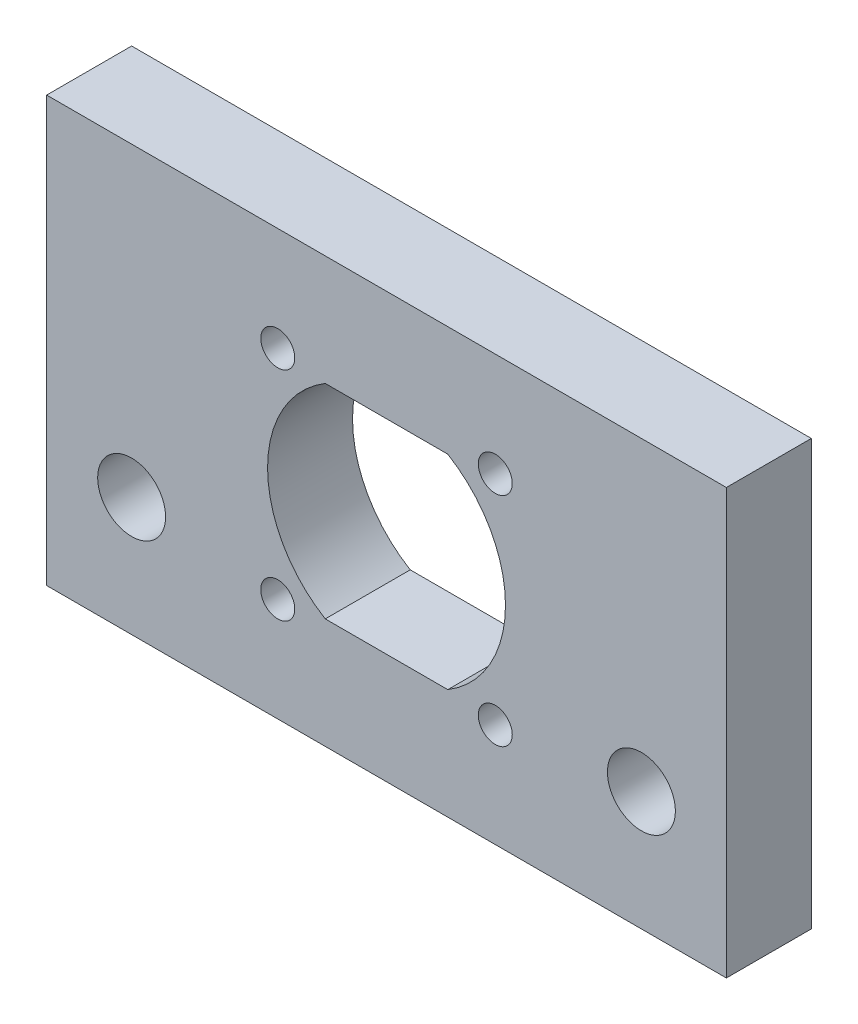
ISO-10303-21;
HEADER;
FILE_DESCRIPTION(('STEP AP214'),'2;1');
FILE_NAME('part.step','',(''),(''),'','','');
FILE_SCHEMA(('AUTOMOTIVE_DESIGN { 1 0 10303 214 1 1 1 1 }'));
ENDSEC;
DATA;
#1=APPLICATION_CONTEXT('core data for automotive mechanical design processes');
#2=APPLICATION_PROTOCOL_DEFINITION('international standard','automotive_design',2000,#1);
#3=PRODUCT_CONTEXT('',#1,'mechanical');
#4=PRODUCT('Part','Part','',(#3));
#5=PRODUCT_RELATED_PRODUCT_CATEGORY('part','',(#4));
#6=PRODUCT_DEFINITION_FORMATION('','',#4);
#7=PRODUCT_DEFINITION_CONTEXT('part definition',#1,'design');
#8=PRODUCT_DEFINITION('design','',#6,#7);
#9=PRODUCT_DEFINITION_SHAPE('','',#8);
#10=(LENGTH_UNIT() NAMED_UNIT(*) SI_UNIT(.MILLI.,.METRE.));
#11=(NAMED_UNIT(*) PLANE_ANGLE_UNIT() SI_UNIT($,.RADIAN.));
#12=(NAMED_UNIT(*) SI_UNIT($,.STERADIAN.) SOLID_ANGLE_UNIT());
#13=UNCERTAINTY_MEASURE_WITH_UNIT(LENGTH_MEASURE(1.E-05),#10,'distance_accuracy_value','');
#14=(GEOMETRIC_REPRESENTATION_CONTEXT(3) GLOBAL_UNCERTAINTY_ASSIGNED_CONTEXT((#13)) GLOBAL_UNIT_ASSIGNED_CONTEXT((#10,
#11,#12)) REPRESENTATION_CONTEXT('',''));
#15=CARTESIAN_POINT('',(0.,0.,0.));
#16=DIRECTION('',(0.,0.,1.));
#17=DIRECTION('',(1.,0.,0.));
#18=AXIS2_PLACEMENT_3D('',#15,#16,#17);
#19=CARTESIAN_POINT('',(0.,0.,5.));
#20=DIRECTION('',(0.,0.,1.));
#21=DIRECTION('',(1.,0.,0.));
#22=AXIS2_PLACEMENT_3D('',#19,#20,#21);
#23=PLANE('',#22);
#24=CARTESIAN_POINT('',(-6.4,-6.4,5.));
#25=DIRECTION('',(0.,0.,1.));
#26=DIRECTION('',(-1.,0.,0.));
#27=AXIS2_PLACEMENT_3D('',#24,#25,#26);
#28=CIRCLE('',#27,1.);
#29=CARTESIAN_POINT('',(-7.4,-6.4,5.));
#30=VERTEX_POINT('',#29);
#31=EDGE_CURVE('E262',#30,#30,#28,.T.);
#32=ORIENTED_EDGE('',*,*,#31,.F.);
#33=EDGE_LOOP('',(#32));
#34=FACE_BOUND('',#33,.T.);
#35=CARTESIAN_POINT('',(6.4,6.4,5.));
#36=DIRECTION('',(0.,0.,1.));
#37=DIRECTION('',(-1.,0.,0.));
#38=AXIS2_PLACEMENT_3D('',#35,#36,#37);
#39=CIRCLE('',#38,1.);
#40=CARTESIAN_POINT('',(5.4,6.4,5.));
#41=VERTEX_POINT('',#40);
#42=EDGE_CURVE('E274',#41,#41,#39,.T.);
#43=ORIENTED_EDGE('',*,*,#42,.F.);
#44=EDGE_LOOP('',(#43));
#45=FACE_BOUND('',#44,.T.);
#46=CARTESIAN_POINT('',(-6.4,6.4,5.));
#47=DIRECTION('',(0.,0.,1.));
#48=DIRECTION('',(1.,0.,0.));
#49=AXIS2_PLACEMENT_3D('',#46,#47,#48);
#50=CIRCLE('',#49,1.);
#51=CARTESIAN_POINT('',(-5.4,6.4,5.));
#52=VERTEX_POINT('',#51);
#53=EDGE_CURVE('E136',#52,#52,#50,.T.);
#54=ORIENTED_EDGE('',*,*,#53,.F.);
#55=EDGE_LOOP('',(#54));
#56=FACE_BOUND('',#55,.T.);
#57=DIRECTION('',(0.,1.,0.));
#58=VECTOR('',#57,1.);
#59=CARTESIAN_POINT('',(20.,12.5,5.));
#60=LINE('',#59,#58);
#61=CARTESIAN_POINT('',(20.,-12.5,5.));
#62=VERTEX_POINT('',#61);
#63=CARTESIAN_POINT('',(20.,12.5,5.));
#64=VERTEX_POINT('',#63);
#65=EDGE_CURVE('E146',#62,#64,#60,.T.);
#66=ORIENTED_EDGE('',*,*,#65,.T.);
#67=DIRECTION('',(-1.,0.,0.));
#68=VECTOR('',#67,1.);
#69=CARTESIAN_POINT('',(-20.,12.5,5.));
#70=LINE('',#69,#68);
#71=CARTESIAN_POINT('',(-20.,12.5,5.));
#72=VERTEX_POINT('',#71);
#73=EDGE_CURVE('E149',#64,#72,#70,.T.);
#74=ORIENTED_EDGE('',*,*,#73,.T.);
#75=DIRECTION('',(0.,-1.,0.));
#76=VECTOR('',#75,1.);
#77=CARTESIAN_POINT('',(-20.,12.5,5.));
#78=LINE('',#77,#76);
#79=CARTESIAN_POINT('',(-20.,-12.5,5.));
#80=VERTEX_POINT('',#79);
#81=EDGE_CURVE('E152',#72,#80,#78,.T.);
#82=ORIENTED_EDGE('',*,*,#81,.T.);
#83=DIRECTION('',(1.,0.,0.));
#84=VECTOR('',#83,1.);
#85=CARTESIAN_POINT('',(-20.,-12.5,5.));
#86=LINE('',#85,#84);
#87=EDGE_CURVE('E154',#80,#62,#86,.T.);
#88=ORIENTED_EDGE('',*,*,#87,.T.);
#89=EDGE_LOOP('',(#66,#74,#82,#88));
#90=FACE_BOUND('',#89,.T.);
#91=DIRECTION('',(-1.,0.,0.));
#92=VECTOR('',#91,1.);
#93=CARTESIAN_POINT('',(-3.60555127546399,6.,5.));
#94=LINE('',#93,#92);
#95=CARTESIAN_POINT('',(3.60555127546399,6.,5.));
#96=VERTEX_POINT('',#95);
#97=CARTESIAN_POINT('',(-3.60555127546399,6.,5.));
#98=VERTEX_POINT('',#97);
#99=EDGE_CURVE('E115',#96,#98,#94,.T.);
#100=ORIENTED_EDGE('',*,*,#99,.F.);
#101=CARTESIAN_POINT('',(0.,0.,5.));
#102=DIRECTION('',(0.,0.,1.));
#103=DIRECTION('',(1.,0.,0.));
#104=AXIS2_PLACEMENT_3D('',#101,#102,#103);
#105=CIRCLE('',#104,7.);
#106=CARTESIAN_POINT('',(3.60555127546399,-6.,5.));
#107=VERTEX_POINT('',#106);
#108=EDGE_CURVE('E107',#107,#96,#105,.T.);
#109=ORIENTED_EDGE('',*,*,#108,.F.);
#110=DIRECTION('',(1.,0.,0.));
#111=VECTOR('',#110,1.);
#112=CARTESIAN_POINT('',(-3.60555127546399,-6.,5.));
#113=LINE('',#112,#111);
#114=CARTESIAN_POINT('',(-3.60555127546399,-6.,5.));
#115=VERTEX_POINT('',#114);
#116=EDGE_CURVE('E130',#115,#107,#113,.T.);
#117=ORIENTED_EDGE('',*,*,#116,.F.);
#118=CARTESIAN_POINT('',(0.,0.,5.));
#119=DIRECTION('',(0.,0.,1.));
#120=DIRECTION('',(1.,0.,0.));
#121=AXIS2_PLACEMENT_3D('',#118,#119,#120);
#122=CIRCLE('',#121,7.);
#123=EDGE_CURVE('E128',#98,#115,#122,.T.);
#124=ORIENTED_EDGE('',*,*,#123,.F.);
#125=EDGE_LOOP('',(#100,#109,#117,#124));
#126=FACE_BOUND('',#125,.T.);
#127=CARTESIAN_POINT('',(15.,-5.5,5.));
#128=DIRECTION('',(0.,0.,1.));
#129=DIRECTION('',(1.,0.,0.));
#130=AXIS2_PLACEMENT_3D('',#127,#128,#129);
#131=CIRCLE('',#130,2.);
#132=CARTESIAN_POINT('',(17.,-5.5,5.));
#133=VERTEX_POINT('',#132);
#134=EDGE_CURVE('E280',#133,#133,#131,.T.);
#135=ORIENTED_EDGE('',*,*,#134,.F.);
#136=EDGE_LOOP('',(#135));
#137=FACE_BOUND('',#136,.T.);
#138=CARTESIAN_POINT('',(6.4,-6.4,5.));
#139=DIRECTION('',(0.,0.,1.));
#140=DIRECTION('',(1.,0.,0.));
#141=AXIS2_PLACEMENT_3D('',#138,#139,#140);
#142=CIRCLE('',#141,1.);
#143=CARTESIAN_POINT('',(7.40000000000001,-6.4,5.));
#144=VERTEX_POINT('',#143);
#145=EDGE_CURVE('E268',#144,#144,#142,.T.);
#146=ORIENTED_EDGE('',*,*,#145,.F.);
#147=EDGE_LOOP('',(#146));
#148=FACE_BOUND('',#147,.T.);
#149=CARTESIAN_POINT('',(-15.,-5.5,5.));
#150=DIRECTION('',(0.,0.,1.));
#151=DIRECTION('',(-1.,0.,0.));
#152=AXIS2_PLACEMENT_3D('',#149,#150,#151);
#153=CIRCLE('',#152,2.);
#154=CARTESIAN_POINT('',(-17.,-5.5,5.));
#155=VERTEX_POINT('',#154);
#156=EDGE_CURVE('E253',#155,#155,#153,.T.);
#157=ORIENTED_EDGE('',*,*,#156,.F.);
#158=EDGE_LOOP('',(#157));
#159=FACE_BOUND('',#158,.T.);
#160=ADVANCED_FACE('F42',(#34,#45,#56,#90,#126,#137,#148,#159),#23,.T.);
#161=CARTESIAN_POINT('',(0.,0.,0.));
#162=DIRECTION('',(0.,0.,1.));
#163=DIRECTION('',(1.,0.,0.));
#164=AXIS2_PLACEMENT_3D('',#161,#162,#163);
#165=PLANE('',#164);
#166=DIRECTION('',(0.,1.,0.));
#167=VECTOR('',#166,1.);
#168=CARTESIAN_POINT('',(20.,12.5,0.));
#169=LINE('',#168,#167);
#170=CARTESIAN_POINT('',(20.,-12.5,0.));
#171=VERTEX_POINT('',#170);
#172=CARTESIAN_POINT('',(20.,12.5,0.));
#173=VERTEX_POINT('',#172);
#174=EDGE_CURVE('E123',#171,#173,#169,.T.);
#175=ORIENTED_EDGE('',*,*,#174,.F.);
#176=DIRECTION('',(1.,0.,0.));
#177=VECTOR('',#176,1.);
#178=CARTESIAN_POINT('',(-20.,-12.5,0.));
#179=LINE('',#178,#177);
#180=CARTESIAN_POINT('',(-20.,-12.5,0.));
#181=VERTEX_POINT('',#180);
#182=EDGE_CURVE('E150',#181,#171,#179,.T.);
#183=ORIENTED_EDGE('',*,*,#182,.F.);
#184=DIRECTION('',(0.,-1.,0.));
#185=VECTOR('',#184,1.);
#186=CARTESIAN_POINT('',(-20.,12.5,0.));
#187=LINE('',#186,#185);
#188=CARTESIAN_POINT('',(-20.,12.5,0.));
#189=VERTEX_POINT('',#188);
#190=EDGE_CURVE('E161',#189,#181,#187,.T.);
#191=ORIENTED_EDGE('',*,*,#190,.F.);
#192=DIRECTION('',(-1.,0.,0.));
#193=VECTOR('',#192,1.);
#194=CARTESIAN_POINT('',(-20.,12.5,0.));
#195=LINE('',#194,#193);
#196=EDGE_CURVE('E159',#173,#189,#195,.T.);
#197=ORIENTED_EDGE('',*,*,#196,.F.);
#198=EDGE_LOOP('',(#175,#183,#191,#197));
#199=FACE_BOUND('',#198,.T.);
#200=CARTESIAN_POINT('',(0.,0.,0.));
#201=DIRECTION('',(0.,0.,1.));
#202=DIRECTION('',(1.,0.,0.));
#203=AXIS2_PLACEMENT_3D('',#200,#201,#202);
#204=CIRCLE('',#203,7.);
#205=CARTESIAN_POINT('',(3.60555127546399,-6.,0.));
#206=VERTEX_POINT('',#205);
#207=CARTESIAN_POINT('',(3.60555127546399,6.,0.));
#208=VERTEX_POINT('',#207);
#209=EDGE_CURVE('E65',#206,#208,#204,.T.);
#210=ORIENTED_EDGE('',*,*,#209,.T.);
#211=DIRECTION('',(-1.,0.,0.));
#212=VECTOR('',#211,1.);
#213=CARTESIAN_POINT('',(-3.60555127546399,6.,0.));
#214=LINE('',#213,#212);
#215=CARTESIAN_POINT('',(-3.60555127546399,6.,0.));
#216=VERTEX_POINT('',#215);
#217=EDGE_CURVE('E122',#208,#216,#214,.T.);
#218=ORIENTED_EDGE('',*,*,#217,.T.);
#219=CARTESIAN_POINT('',(0.,0.,0.));
#220=DIRECTION('',(0.,0.,1.));
#221=DIRECTION('',(1.,0.,0.));
#222=AXIS2_PLACEMENT_3D('',#219,#220,#221);
#223=CIRCLE('',#222,7.);
#224=CARTESIAN_POINT('',(-3.60555127546399,-6.,0.));
#225=VERTEX_POINT('',#224);
#226=EDGE_CURVE('E138',#216,#225,#223,.T.);
#227=ORIENTED_EDGE('',*,*,#226,.T.);
#228=DIRECTION('',(1.,0.,0.));
#229=VECTOR('',#228,1.);
#230=CARTESIAN_POINT('',(-3.60555127546399,-6.,0.));
#231=LINE('',#230,#229);
#232=EDGE_CURVE('E116',#225,#206,#231,.T.);
#233=ORIENTED_EDGE('',*,*,#232,.T.);
#234=EDGE_LOOP('',(#210,#218,#227,#233));
#235=FACE_BOUND('',#234,.T.);
#236=CARTESIAN_POINT('',(-6.4,6.4,0.));
#237=DIRECTION('',(0.,0.,1.));
#238=DIRECTION('',(1.,0.,0.));
#239=AXIS2_PLACEMENT_3D('',#236,#237,#238);
#240=CIRCLE('',#239,1.);
#241=CARTESIAN_POINT('',(-5.4,6.4,0.));
#242=VERTEX_POINT('',#241);
#243=EDGE_CURVE('E283',#242,#242,#240,.T.);
#244=ORIENTED_EDGE('',*,*,#243,.T.);
#245=EDGE_LOOP('',(#244));
#246=FACE_BOUND('',#245,.T.);
#247=CARTESIAN_POINT('',(15.,-5.5,0.));
#248=DIRECTION('',(0.,0.,1.));
#249=DIRECTION('',(1.,0.,0.));
#250=AXIS2_PLACEMENT_3D('',#247,#248,#249);
#251=CIRCLE('',#250,2.);
#252=CARTESIAN_POINT('',(17.,-5.5,0.));
#253=VERTEX_POINT('',#252);
#254=EDGE_CURVE('E277',#253,#253,#251,.T.);
#255=ORIENTED_EDGE('',*,*,#254,.T.);
#256=EDGE_LOOP('',(#255));
#257=FACE_BOUND('',#256,.T.);
#258=CARTESIAN_POINT('',(6.4,6.4,0.));
#259=DIRECTION('',(0.,0.,1.));
#260=DIRECTION('',(-1.,0.,0.));
#261=AXIS2_PLACEMENT_3D('',#258,#259,#260);
#262=CIRCLE('',#261,1.);
#263=CARTESIAN_POINT('',(5.4,6.4,0.));
#264=VERTEX_POINT('',#263);
#265=EDGE_CURVE('E271',#264,#264,#262,.T.);
#266=ORIENTED_EDGE('',*,*,#265,.T.);
#267=EDGE_LOOP('',(#266));
#268=FACE_BOUND('',#267,.T.);
#269=CARTESIAN_POINT('',(6.4,-6.4,0.));
#270=DIRECTION('',(0.,0.,1.));
#271=DIRECTION('',(1.,0.,0.));
#272=AXIS2_PLACEMENT_3D('',#269,#270,#271);
#273=CIRCLE('',#272,1.);
#274=CARTESIAN_POINT('',(7.40000000000001,-6.4,0.));
#275=VERTEX_POINT('',#274);
#276=EDGE_CURVE('E265',#275,#275,#273,.T.);
#277=ORIENTED_EDGE('',*,*,#276,.T.);
#278=EDGE_LOOP('',(#277));
#279=FACE_BOUND('',#278,.T.);
#280=CARTESIAN_POINT('',(-6.4,-6.4,0.));
#281=DIRECTION('',(0.,0.,1.));
#282=DIRECTION('',(-1.,0.,0.));
#283=AXIS2_PLACEMENT_3D('',#280,#281,#282);
#284=CIRCLE('',#283,1.);
#285=CARTESIAN_POINT('',(-7.4,-6.4,0.));
#286=VERTEX_POINT('',#285);
#287=EDGE_CURVE('E259',#286,#286,#284,.T.);
#288=ORIENTED_EDGE('',*,*,#287,.T.);
#289=EDGE_LOOP('',(#288));
#290=FACE_BOUND('',#289,.T.);
#291=CARTESIAN_POINT('',(-15.,-5.5,0.));
#292=DIRECTION('',(0.,0.,1.));
#293=DIRECTION('',(-1.,0.,0.));
#294=AXIS2_PLACEMENT_3D('',#291,#292,#293);
#295=CIRCLE('',#294,2.);
#296=CARTESIAN_POINT('',(-17.,-5.5,0.));
#297=VERTEX_POINT('',#296);
#298=EDGE_CURVE('E256',#297,#297,#295,.T.);
#299=ORIENTED_EDGE('',*,*,#298,.T.);
#300=EDGE_LOOP('',(#299));
#301=FACE_BOUND('',#300,.T.);
#302=ADVANCED_FACE('F179',(#199,#235,#246,#257,#268,#279,#290,#301),#165,.F.);
#303=CARTESIAN_POINT('',(20.,12.5,5.));
#304=DIRECTION('',(-1.,0.,0.));
#305=DIRECTION('',(0.,-1.,0.));
#306=AXIS2_PLACEMENT_3D('',#303,#304,#305);
#307=PLANE('',#306);
#308=ORIENTED_EDGE('',*,*,#174,.T.);
#309=DIRECTION('',(0.,0.,-1.));
#310=VECTOR('',#309,1.);
#311=CARTESIAN_POINT('',(20.,12.5,5.));
#312=LINE('',#311,#310);
#313=EDGE_CURVE('E13',#64,#173,#312,.T.);
#314=ORIENTED_EDGE('',*,*,#313,.F.);
#315=ORIENTED_EDGE('',*,*,#65,.F.);
#316=DIRECTION('',(0.,0.,-1.));
#317=VECTOR('',#316,1.);
#318=CARTESIAN_POINT('',(20.,-12.5,5.));
#319=LINE('',#318,#317);
#320=EDGE_CURVE('E156',#62,#171,#319,.T.);
#321=ORIENTED_EDGE('',*,*,#320,.T.);
#322=EDGE_LOOP('',(#308,#314,#315,#321));
#323=FACE_BOUND('',#322,.T.);
#324=ADVANCED_FACE('F44',(#323),#307,.F.);
#325=CARTESIAN_POINT('',(-20.,12.5,5.));
#326=DIRECTION('',(0.,-1.,0.));
#327=DIRECTION('',(0.,0.,-1.));
#328=AXIS2_PLACEMENT_3D('',#325,#326,#327);
#329=PLANE('',#328);
#330=ORIENTED_EDGE('',*,*,#196,.T.);
#331=DIRECTION('',(0.,0.,-1.));
#332=VECTOR('',#331,1.);
#333=CARTESIAN_POINT('',(-20.,12.5,5.));
#334=LINE('',#333,#332);
#335=EDGE_CURVE('E50',#72,#189,#334,.T.);
#336=ORIENTED_EDGE('',*,*,#335,.F.);
#337=ORIENTED_EDGE('',*,*,#73,.F.);
#338=ORIENTED_EDGE('',*,*,#313,.T.);
#339=EDGE_LOOP('',(#330,#336,#337,#338));
#340=FACE_BOUND('',#339,.T.);
#341=ADVANCED_FACE('F189',(#340),#329,.F.);
#342=CARTESIAN_POINT('',(-20.,12.5,5.));
#343=DIRECTION('',(1.,0.,0.));
#344=DIRECTION('',(0.,1.,0.));
#345=AXIS2_PLACEMENT_3D('',#342,#343,#344);
#346=PLANE('',#345);
#347=ORIENTED_EDGE('',*,*,#190,.T.);
#348=DIRECTION('',(0.,0.,-1.));
#349=VECTOR('',#348,1.);
#350=CARTESIAN_POINT('',(-20.,-12.5,5.));
#351=LINE('',#350,#349);
#352=EDGE_CURVE('E166',#80,#181,#351,.T.);
#353=ORIENTED_EDGE('',*,*,#352,.F.);
#354=ORIENTED_EDGE('',*,*,#81,.F.);
#355=ORIENTED_EDGE('',*,*,#335,.T.);
#356=EDGE_LOOP('',(#347,#353,#354,#355));
#357=FACE_BOUND('',#356,.T.);
#358=ADVANCED_FACE('F173',(#357),#346,.F.);
#359=CARTESIAN_POINT('',(-20.,-12.5,5.));
#360=DIRECTION('',(0.,1.,0.));
#361=DIRECTION('',(0.,0.,1.));
#362=AXIS2_PLACEMENT_3D('',#359,#360,#361);
#363=PLANE('',#362);
#364=ORIENTED_EDGE('',*,*,#182,.T.);
#365=ORIENTED_EDGE('',*,*,#320,.F.);
#366=ORIENTED_EDGE('',*,*,#87,.F.);
#367=ORIENTED_EDGE('',*,*,#352,.T.);
#368=EDGE_LOOP('',(#364,#365,#366,#367));
#369=FACE_BOUND('',#368,.T.);
#370=ADVANCED_FACE('F183',(#369),#363,.F.);
#371=CARTESIAN_POINT('',(0.,0.,5.));
#372=DIRECTION('',(0.,0.,-1.));
#373=DIRECTION('',(-1.,0.,0.));
#374=AXIS2_PLACEMENT_3D('',#371,#372,#373);
#375=CYLINDRICAL_SURFACE('',#374,7.);
#376=ORIENTED_EDGE('',*,*,#209,.F.);
#377=DIRECTION('',(0.,0.,-1.));
#378=VECTOR('',#377,1.);
#379=CARTESIAN_POINT('',(3.60555127546399,-6.,5.));
#380=LINE('',#379,#378);
#381=EDGE_CURVE('E111',#107,#206,#380,.T.);
#382=ORIENTED_EDGE('',*,*,#381,.F.);
#383=ORIENTED_EDGE('',*,*,#108,.T.);
#384=DIRECTION('',(0.,0.,-1.));
#385=VECTOR('',#384,1.);
#386=CARTESIAN_POINT('',(3.60555127546399,6.,5.));
#387=LINE('',#386,#385);
#388=EDGE_CURVE('E110',#96,#208,#387,.T.);
#389=ORIENTED_EDGE('',*,*,#388,.T.);
#390=EDGE_LOOP('',(#376,#382,#383,#389));
#391=FACE_BOUND('',#390,.T.);
#392=ADVANCED_FACE('F109',(#391),#375,.F.);
#393=CARTESIAN_POINT('',(-3.60555127546399,6.,5.));
#394=DIRECTION('',(0.,-1.,0.));
#395=DIRECTION('',(0.,0.,-1.));
#396=AXIS2_PLACEMENT_3D('',#393,#394,#395);
#397=PLANE('',#396);
#398=ORIENTED_EDGE('',*,*,#217,.F.);
#399=ORIENTED_EDGE('',*,*,#388,.F.);
#400=ORIENTED_EDGE('',*,*,#99,.T.);
#401=DIRECTION('',(0.,0.,-1.));
#402=VECTOR('',#401,1.);
#403=CARTESIAN_POINT('',(-3.60555127546399,6.,5.));
#404=LINE('',#403,#402);
#405=EDGE_CURVE('E124',#98,#216,#404,.T.);
#406=ORIENTED_EDGE('',*,*,#405,.T.);
#407=EDGE_LOOP('',(#398,#399,#400,#406));
#408=FACE_BOUND('',#407,.T.);
#409=ADVANCED_FACE('F119',(#408),#397,.T.);
#410=CARTESIAN_POINT('',(0.,0.,5.));
#411=DIRECTION('',(0.,0.,-1.));
#412=DIRECTION('',(-1.,0.,0.));
#413=AXIS2_PLACEMENT_3D('',#410,#411,#412);
#414=CYLINDRICAL_SURFACE('',#413,7.);
#415=ORIENTED_EDGE('',*,*,#226,.F.);
#416=ORIENTED_EDGE('',*,*,#405,.F.);
#417=ORIENTED_EDGE('',*,*,#123,.T.);
#418=DIRECTION('',(0.,0.,-1.));
#419=VECTOR('',#418,1.);
#420=CARTESIAN_POINT('',(-3.60555127546399,-6.,5.));
#421=LINE('',#420,#419);
#422=EDGE_CURVE('E57',#115,#225,#421,.T.);
#423=ORIENTED_EDGE('',*,*,#422,.T.);
#424=EDGE_LOOP('',(#415,#416,#417,#423));
#425=FACE_BOUND('',#424,.T.);
#426=ADVANCED_FACE('F215',(#425),#414,.F.);
#427=CARTESIAN_POINT('',(-3.60555127546399,-6.,5.));
#428=DIRECTION('',(0.,1.,0.));
#429=DIRECTION('',(0.,0.,1.));
#430=AXIS2_PLACEMENT_3D('',#427,#428,#429);
#431=PLANE('',#430);
#432=ORIENTED_EDGE('',*,*,#232,.F.);
#433=ORIENTED_EDGE('',*,*,#422,.F.);
#434=ORIENTED_EDGE('',*,*,#116,.T.);
#435=ORIENTED_EDGE('',*,*,#381,.T.);
#436=EDGE_LOOP('',(#432,#433,#434,#435));
#437=FACE_BOUND('',#436,.T.);
#438=ADVANCED_FACE('F219',(#437),#431,.T.);
#439=CARTESIAN_POINT('',(-6.4,6.4,5.));
#440=DIRECTION('',(0.,0.,-1.));
#441=DIRECTION('',(-1.,0.,0.));
#442=AXIS2_PLACEMENT_3D('',#439,#440,#441);
#443=CYLINDRICAL_SURFACE('',#442,1.);
#444=ORIENTED_EDGE('',*,*,#53,.T.);
#445=EDGE_LOOP('',(#444));
#446=FACE_BOUND('',#445,.T.);
#447=ORIENTED_EDGE('',*,*,#243,.F.);
#448=EDGE_LOOP('',(#447));
#449=FACE_BOUND('',#448,.T.);
#450=ADVANCED_FACE('F225',(#446,#449),#443,.F.);
#451=CARTESIAN_POINT('',(15.,-5.5,5.));
#452=DIRECTION('',(0.,0.,-1.));
#453=DIRECTION('',(-1.,0.,0.));
#454=AXIS2_PLACEMENT_3D('',#451,#452,#453);
#455=CYLINDRICAL_SURFACE('',#454,2.);
#456=ORIENTED_EDGE('',*,*,#134,.T.);
#457=EDGE_LOOP('',(#456));
#458=FACE_BOUND('',#457,.T.);
#459=ORIENTED_EDGE('',*,*,#254,.F.);
#460=EDGE_LOOP('',(#459));
#461=FACE_BOUND('',#460,.T.);
#462=ADVANCED_FACE('F228',(#458,#461),#455,.F.);
#463=CARTESIAN_POINT('',(6.4,6.4,5.));
#464=DIRECTION('',(0.,0.,-1.));
#465=DIRECTION('',(-1.,0.,0.));
#466=AXIS2_PLACEMENT_3D('',#463,#464,#465);
#467=CYLINDRICAL_SURFACE('',#466,1.);
#468=ORIENTED_EDGE('',*,*,#42,.T.);
#469=EDGE_LOOP('',(#468));
#470=FACE_BOUND('',#469,.T.);
#471=ORIENTED_EDGE('',*,*,#265,.F.);
#472=EDGE_LOOP('',(#471));
#473=FACE_BOUND('',#472,.T.);
#474=ADVANCED_FACE('F232',(#470,#473),#467,.F.);
#475=CARTESIAN_POINT('',(6.4,-6.4,5.));
#476=DIRECTION('',(0.,0.,-1.));
#477=DIRECTION('',(-1.,0.,0.));
#478=AXIS2_PLACEMENT_3D('',#475,#476,#477);
#479=CYLINDRICAL_SURFACE('',#478,1.);
#480=ORIENTED_EDGE('',*,*,#145,.T.);
#481=EDGE_LOOP('',(#480));
#482=FACE_BOUND('',#481,.T.);
#483=ORIENTED_EDGE('',*,*,#276,.F.);
#484=EDGE_LOOP('',(#483));
#485=FACE_BOUND('',#484,.T.);
#486=ADVANCED_FACE('F236',(#482,#485),#479,.F.);
#487=CARTESIAN_POINT('',(-6.4,-6.4,5.));
#488=DIRECTION('',(0.,0.,-1.));
#489=DIRECTION('',(-1.,0.,0.));
#490=AXIS2_PLACEMENT_3D('',#487,#488,#489);
#491=CYLINDRICAL_SURFACE('',#490,1.);
#492=ORIENTED_EDGE('',*,*,#31,.T.);
#493=EDGE_LOOP('',(#492));
#494=FACE_BOUND('',#493,.T.);
#495=ORIENTED_EDGE('',*,*,#287,.F.);
#496=EDGE_LOOP('',(#495));
#497=FACE_BOUND('',#496,.T.);
#498=ADVANCED_FACE('F240',(#494,#497),#491,.F.);
#499=CARTESIAN_POINT('',(-15.,-5.5,5.));
#500=DIRECTION('',(0.,0.,-1.));
#501=DIRECTION('',(-1.,0.,0.));
#502=AXIS2_PLACEMENT_3D('',#499,#500,#501);
#503=CYLINDRICAL_SURFACE('',#502,2.);
#504=ORIENTED_EDGE('',*,*,#156,.T.);
#505=EDGE_LOOP('',(#504));
#506=FACE_BOUND('',#505,.T.);
#507=ORIENTED_EDGE('',*,*,#298,.F.);
#508=EDGE_LOOP('',(#507));
#509=FACE_BOUND('',#508,.T.);
#510=ADVANCED_FACE('F244',(#506,#509),#503,.F.);
#511=CLOSED_SHELL('',(#160,#302,#324,#341,#358,#370,#392,#409,#426,#438,#450,#462,#474,#486,
#498,#510));
#512=MANIFOLD_SOLID_BREP('B2',#511);
#513=ADVANCED_BREP_SHAPE_REPRESENTATION('',(#18,#512),#14);
#514=SHAPE_DEFINITION_REPRESENTATION(#9,#513);
ENDSEC;
END-ISO-10303-21;
